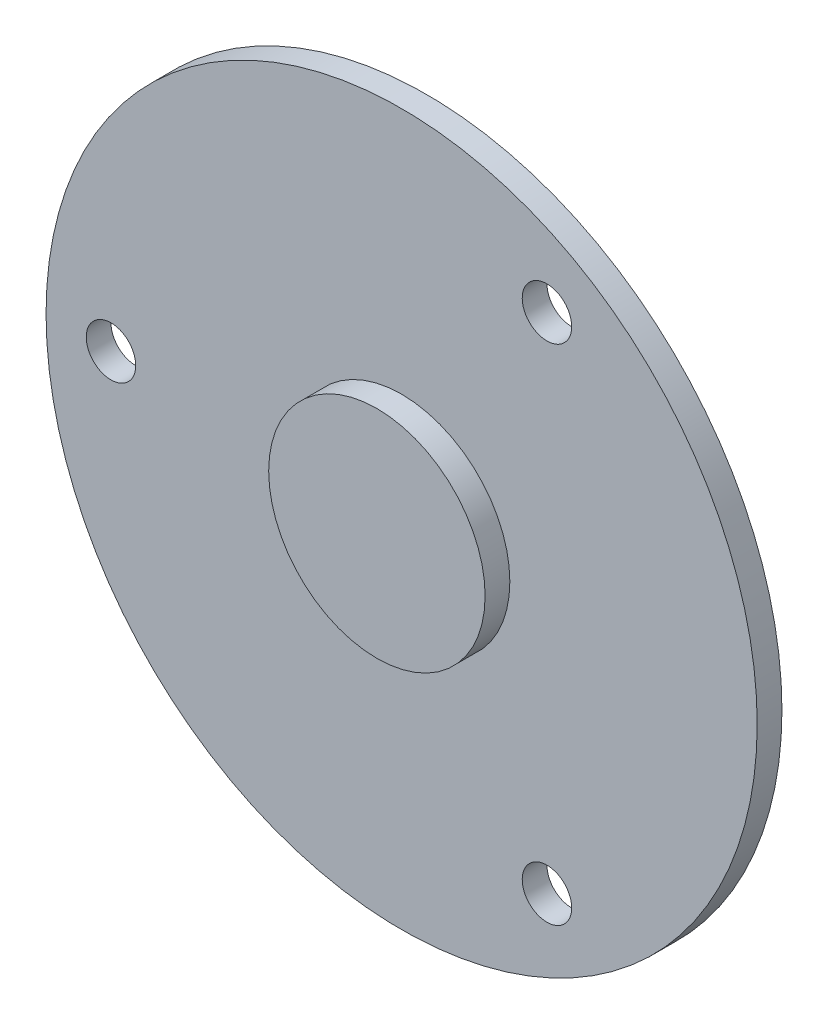
ISO-10303-21;
HEADER;
FILE_DESCRIPTION(('STEP AP214'),'2;1');
FILE_NAME('part.step','',(''),(''),'','','');
FILE_SCHEMA(('AUTOMOTIVE_DESIGN { 1 0 10303 214 1 1 1 1 }'));
ENDSEC;
DATA;
#1=APPLICATION_CONTEXT('core data for automotive mechanical design processes');
#2=APPLICATION_PROTOCOL_DEFINITION('international standard','automotive_design',2000,#1);
#3=PRODUCT_CONTEXT('',#1,'mechanical');
#4=PRODUCT('Part','Part','',(#3));
#5=PRODUCT_RELATED_PRODUCT_CATEGORY('part','',(#4));
#6=PRODUCT_DEFINITION_FORMATION('','',#4);
#7=PRODUCT_DEFINITION_CONTEXT('part definition',#1,'design');
#8=PRODUCT_DEFINITION('design','',#6,#7);
#9=PRODUCT_DEFINITION_SHAPE('','',#8);
#10=(LENGTH_UNIT() NAMED_UNIT(*) SI_UNIT(.MILLI.,.METRE.));
#11=(NAMED_UNIT(*) PLANE_ANGLE_UNIT() SI_UNIT($,.RADIAN.));
#12=(NAMED_UNIT(*) SI_UNIT($,.STERADIAN.) SOLID_ANGLE_UNIT());
#13=UNCERTAINTY_MEASURE_WITH_UNIT(LENGTH_MEASURE(1.E-05),#10,'distance_accuracy_value','');
#14=(GEOMETRIC_REPRESENTATION_CONTEXT(3) GLOBAL_UNCERTAINTY_ASSIGNED_CONTEXT((#13)) GLOBAL_UNIT_ASSIGNED_CONTEXT((#10,
#11,#12)) REPRESENTATION_CONTEXT('',''));
#15=CARTESIAN_POINT('',(0.,0.,0.));
#16=DIRECTION('',(0.,0.,1.));
#17=DIRECTION('',(1.,0.,0.));
#18=AXIS2_PLACEMENT_3D('',#15,#16,#17);
#19=CARTESIAN_POINT('',(0.,0.,4.));
#20=DIRECTION('',(0.,0.,1.));
#21=DIRECTION('',(1.,0.,0.));
#22=AXIS2_PLACEMENT_3D('',#19,#20,#21);
#23=PLANE('',#22);
#24=CARTESIAN_POINT('',(23.4999999999996,-40.7031939778688,4.));
#25=DIRECTION('',(0.,0.,1.));
#26=DIRECTION('',(1.,0.,0.));
#27=AXIS2_PLACEMENT_3D('',#24,#25,#26);
#28=CIRCLE('',#27,4.);
#29=CARTESIAN_POINT('',(27.4999999999996,-40.7031939778688,4.));
#30=VERTEX_POINT('',#29);
#31=EDGE_CURVE('E60',#30,#30,#28,.T.);
#32=ORIENTED_EDGE('',*,*,#31,.F.);
#33=EDGE_LOOP('',(#32));
#34=FACE_BOUND('',#33,.T.);
#35=CARTESIAN_POINT('',(23.5000000000002,40.7031939778685,4.));
#36=DIRECTION('',(0.,0.,1.));
#37=DIRECTION('',(1.,0.,0.));
#38=AXIS2_PLACEMENT_3D('',#35,#36,#37);
#39=CIRCLE('',#38,4.);
#40=CARTESIAN_POINT('',(27.5000000000002,40.7031939778685,4.));
#41=VERTEX_POINT('',#40);
#42=EDGE_CURVE('E54',#41,#41,#39,.T.);
#43=ORIENTED_EDGE('',*,*,#42,.F.);
#44=EDGE_LOOP('',(#43));
#45=FACE_BOUND('',#44,.T.);
#46=CARTESIAN_POINT('',(-47.,0.,4.));
#47=DIRECTION('',(0.,0.,1.));
#48=DIRECTION('',(1.,0.,0.));
#49=AXIS2_PLACEMENT_3D('',#46,#47,#48);
#50=CIRCLE('',#49,4.);
#51=CARTESIAN_POINT('',(-43.,0.,4.));
#52=VERTEX_POINT('',#51);
#53=EDGE_CURVE('E46',#52,#52,#50,.T.);
#54=ORIENTED_EDGE('',*,*,#53,.F.);
#55=EDGE_LOOP('',(#54));
#56=FACE_BOUND('',#55,.T.);
#57=CARTESIAN_POINT('',(0.,0.,4.));
#58=DIRECTION('',(0.,0.,1.));
#59=DIRECTION('',(1.,0.,0.));
#60=AXIS2_PLACEMENT_3D('',#57,#58,#59);
#61=CIRCLE('',#60,57.5);
#62=CARTESIAN_POINT('',(57.5,0.,4.));
#63=VERTEX_POINT('',#62);
#64=EDGE_CURVE('E10',#63,#63,#61,.T.);
#65=ORIENTED_EDGE('',*,*,#64,.T.);
#66=EDGE_LOOP('',(#65));
#67=FACE_BOUND('',#66,.T.);
#68=CARTESIAN_POINT('',(0.,0.,4.));
#69=DIRECTION('',(0.,0.,1.));
#70=DIRECTION('',(1.,0.,0.));
#71=AXIS2_PLACEMENT_3D('',#68,#69,#70);
#72=CIRCLE('',#71,17.5);
#73=CARTESIAN_POINT('',(17.5,0.,4.));
#74=VERTEX_POINT('',#73);
#75=EDGE_CURVE('E43',#74,#74,#72,.T.);
#76=ORIENTED_EDGE('',*,*,#75,.F.);
#77=EDGE_LOOP('',(#76));
#78=FACE_BOUND('',#77,.T.);
#79=ADVANCED_FACE('F30',(#34,#45,#56,#67,#78),#23,.T.);
#80=CARTESIAN_POINT('',(0.,0.,4.));
#81=DIRECTION('',(0.,0.,-1.));
#82=DIRECTION('',(-1.,0.,0.));
#83=AXIS2_PLACEMENT_3D('',#80,#81,#82);
#84=CYLINDRICAL_SURFACE('',#83,57.5);
#85=ORIENTED_EDGE('',*,*,#64,.F.);
#86=EDGE_LOOP('',(#85));
#87=FACE_BOUND('',#86,.T.);
#88=CARTESIAN_POINT('',(0.,0.,0.));
#89=DIRECTION('',(0.,0.,1.));
#90=DIRECTION('',(1.,0.,0.));
#91=AXIS2_PLACEMENT_3D('',#88,#89,#90);
#92=CIRCLE('',#91,57.5);
#93=CARTESIAN_POINT('',(57.5,0.,0.));
#94=VERTEX_POINT('',#93);
#95=EDGE_CURVE('E34',#94,#94,#92,.T.);
#96=ORIENTED_EDGE('',*,*,#95,.T.);
#97=EDGE_LOOP('',(#96));
#98=FACE_BOUND('',#97,.T.);
#99=ADVANCED_FACE('F32',(#87,#98),#84,.T.);
#100=CARTESIAN_POINT('',(0.,0.,0.));
#101=DIRECTION('',(0.,0.,1.));
#102=DIRECTION('',(1.,0.,0.));
#103=AXIS2_PLACEMENT_3D('',#100,#101,#102);
#104=PLANE('',#103);
#105=CARTESIAN_POINT('',(23.4999999999996,-40.7031939778688,0.));
#106=DIRECTION('',(0.,0.,-1.));
#107=DIRECTION('',(0.499999999999992,-0.866025403784443,0.));
#108=AXIS2_PLACEMENT_3D('',#105,#106,#107);
#109=CIRCLE('',#108,4.);
#110=CARTESIAN_POINT('',(25.4999999999996,-44.1672955930066,0.));
#111=VERTEX_POINT('',#110);
#112=EDGE_CURVE('E63',#111,#111,#109,.T.);
#113=ORIENTED_EDGE('',*,*,#112,.F.);
#114=EDGE_LOOP('',(#113));
#115=FACE_BOUND('',#114,.T.);
#116=CARTESIAN_POINT('',(23.5000000000002,40.7031939778685,0.));
#117=DIRECTION('',(0.,0.,-1.));
#118=DIRECTION('',(0.500000000000004,0.866025403784436,0.));
#119=AXIS2_PLACEMENT_3D('',#116,#117,#118);
#120=CIRCLE('',#119,4.);
#121=CARTESIAN_POINT('',(25.5000000000002,44.1672955930063,0.));
#122=VERTEX_POINT('',#121);
#123=EDGE_CURVE('E57',#122,#122,#120,.T.);
#124=ORIENTED_EDGE('',*,*,#123,.F.);
#125=EDGE_LOOP('',(#124));
#126=FACE_BOUND('',#125,.T.);
#127=CARTESIAN_POINT('',(-47.,0.,0.));
#128=DIRECTION('',(0.,0.,-1.));
#129=DIRECTION('',(-1.,0.,0.));
#130=AXIS2_PLACEMENT_3D('',#127,#128,#129);
#131=CIRCLE('',#130,4.);
#132=CARTESIAN_POINT('',(-51.,0.,0.));
#133=VERTEX_POINT('',#132);
#134=EDGE_CURVE('E51',#133,#133,#131,.T.);
#135=ORIENTED_EDGE('',*,*,#134,.F.);
#136=EDGE_LOOP('',(#135));
#137=FACE_BOUND('',#136,.T.);
#138=ORIENTED_EDGE('',*,*,#95,.F.);
#139=EDGE_LOOP('',(#138));
#140=FACE_BOUND('',#139,.T.);
#141=ADVANCED_FACE('F69',(#115,#126,#137,#140),#104,.F.);
#142=CARTESIAN_POINT('',(0.,0.,8.));
#143=DIRECTION('',(0.,0.,-1.));
#144=DIRECTION('',(-1.,0.,0.));
#145=AXIS2_PLACEMENT_3D('',#142,#143,#144);
#146=CYLINDRICAL_SURFACE('',#145,17.5);
#147=CARTESIAN_POINT('',(0.,0.,8.));
#148=DIRECTION('',(0.,0.,1.));
#149=DIRECTION('',(1.,0.,0.));
#150=AXIS2_PLACEMENT_3D('',#147,#148,#149);
#151=CIRCLE('',#150,17.5);
#152=CARTESIAN_POINT('',(17.5,0.,8.));
#153=VERTEX_POINT('',#152);
#154=EDGE_CURVE('E41',#153,#153,#151,.T.);
#155=ORIENTED_EDGE('',*,*,#154,.F.);
#156=EDGE_LOOP('',(#155));
#157=FACE_BOUND('',#156,.T.);
#158=ORIENTED_EDGE('',*,*,#75,.T.);
#159=EDGE_LOOP('',(#158));
#160=FACE_BOUND('',#159,.T.);
#161=ADVANCED_FACE('F72',(#157,#160),#146,.T.);
#162=CARTESIAN_POINT('',(0.,0.,8.));
#163=DIRECTION('',(0.,0.,1.));
#164=DIRECTION('',(1.,0.,0.));
#165=AXIS2_PLACEMENT_3D('',#162,#163,#164);
#166=PLANE('',#165);
#167=ORIENTED_EDGE('',*,*,#154,.T.);
#168=EDGE_LOOP('',(#167));
#169=FACE_BOUND('',#168,.T.);
#170=ADVANCED_FACE('F93',(#169),#166,.T.);
#171=CARTESIAN_POINT('',(-47.,0.,12.));
#172=DIRECTION('',(0.,0.,-1.));
#173=DIRECTION('',(-1.,0.,0.));
#174=AXIS2_PLACEMENT_3D('',#171,#172,#173);
#175=CYLINDRICAL_SURFACE('',#174,4.);
#176=ORIENTED_EDGE('',*,*,#53,.T.);
#177=EDGE_LOOP('',(#176));
#178=FACE_BOUND('',#177,.T.);
#179=ORIENTED_EDGE('',*,*,#134,.T.);
#180=EDGE_LOOP('',(#179));
#181=FACE_BOUND('',#180,.T.);
#182=ADVANCED_FACE('F97',(#178,#181),#175,.F.);
#183=CARTESIAN_POINT('',(23.5000000000002,40.7031939778685,12.));
#184=DIRECTION('',(0.,0.,-1.));
#185=DIRECTION('',(-1.,0.,0.));
#186=AXIS2_PLACEMENT_3D('',#183,#184,#185);
#187=CYLINDRICAL_SURFACE('',#186,4.);
#188=ORIENTED_EDGE('',*,*,#42,.T.);
#189=EDGE_LOOP('',(#188));
#190=FACE_BOUND('',#189,.T.);
#191=ORIENTED_EDGE('',*,*,#123,.T.);
#192=EDGE_LOOP('',(#191));
#193=FACE_BOUND('',#192,.T.);
#194=ADVANCED_FACE('F101',(#190,#193),#187,.F.);
#195=CARTESIAN_POINT('',(23.4999999999996,-40.7031939778688,12.));
#196=DIRECTION('',(0.,0.,-1.));
#197=DIRECTION('',(-1.,0.,0.));
#198=AXIS2_PLACEMENT_3D('',#195,#196,#197);
#199=CYLINDRICAL_SURFACE('',#198,4.);
#200=ORIENTED_EDGE('',*,*,#31,.T.);
#201=EDGE_LOOP('',(#200));
#202=FACE_BOUND('',#201,.T.);
#203=ORIENTED_EDGE('',*,*,#112,.T.);
#204=EDGE_LOOP('',(#203));
#205=FACE_BOUND('',#204,.T.);
#206=ADVANCED_FACE('F67',(#202,#205),#199,.F.);
#207=CLOSED_SHELL('',(#79,#99,#141,#161,#170,#182,#194,#206));
#208=MANIFOLD_SOLID_BREP('B2',#207);
#209=ADVANCED_BREP_SHAPE_REPRESENTATION('',(#18,#208),#14);
#210=SHAPE_DEFINITION_REPRESENTATION(#9,#209);
ENDSEC;
END-ISO-10303-21;
